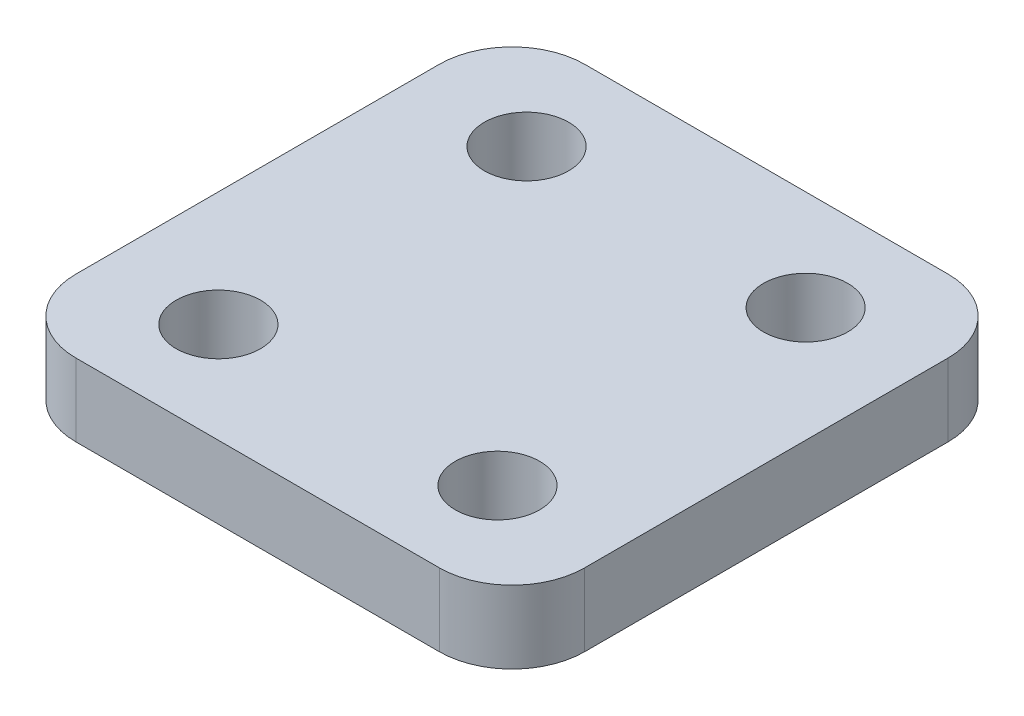
ISO-10303-21;
HEADER;
FILE_DESCRIPTION(('STEP AP214'),'2;1');
FILE_NAME('part.step','',(''),(''),'','','');
FILE_SCHEMA(('AUTOMOTIVE_DESIGN { 1 0 10303 214 1 1 1 1 }'));
ENDSEC;
DATA;
#1=APPLICATION_CONTEXT('core data for automotive mechanical design processes');
#2=APPLICATION_PROTOCOL_DEFINITION('international standard','automotive_design',2000,#1);
#3=PRODUCT_CONTEXT('',#1,'mechanical');
#4=PRODUCT('Part','Part','',(#3));
#5=PRODUCT_RELATED_PRODUCT_CATEGORY('part','',(#4));
#6=PRODUCT_DEFINITION_FORMATION('','',#4);
#7=PRODUCT_DEFINITION_CONTEXT('part definition',#1,'design');
#8=PRODUCT_DEFINITION('design','',#6,#7);
#9=PRODUCT_DEFINITION_SHAPE('','',#8);
#10=(LENGTH_UNIT() NAMED_UNIT(*) SI_UNIT(.MILLI.,.METRE.));
#11=(NAMED_UNIT(*) PLANE_ANGLE_UNIT() SI_UNIT($,.RADIAN.));
#12=(NAMED_UNIT(*) SI_UNIT($,.STERADIAN.) SOLID_ANGLE_UNIT());
#13=UNCERTAINTY_MEASURE_WITH_UNIT(LENGTH_MEASURE(1.E-05),#10,'distance_accuracy_value','');
#14=(GEOMETRIC_REPRESENTATION_CONTEXT(3) GLOBAL_UNCERTAINTY_ASSIGNED_CONTEXT((#13)) GLOBAL_UNIT_ASSIGNED_CONTEXT((#10,
#11,#12)) REPRESENTATION_CONTEXT('',''));
#15=CARTESIAN_POINT('',(0.,0.,0.));
#16=DIRECTION('',(0.,0.,1.));
#17=DIRECTION('',(1.,0.,0.));
#18=AXIS2_PLACEMENT_3D('',#15,#16,#17);
#19=CARTESIAN_POINT('',(8.89,2.54,8.89));
#20=DIRECTION('',(-1.,0.,0.));
#21=DIRECTION('',(0.,0.,1.));
#22=AXIS2_PLACEMENT_3D('',#19,#20,#21);
#23=PLANE('',#22);
#24=DIRECTION('',(0.,0.,-1.));
#25=VECTOR('',#24,1.);
#26=CARTESIAN_POINT('',(8.89,0.,8.89));
#27=LINE('',#26,#25);
#28=CARTESIAN_POINT('',(8.89,0.,6.35));
#29=VERTEX_POINT('',#28);
#30=CARTESIAN_POINT('',(8.89,0.,-6.35));
#31=VERTEX_POINT('',#30);
#32=EDGE_CURVE('E136',#29,#31,#27,.T.);
#33=ORIENTED_EDGE('',*,*,#32,.T.);
#34=DIRECTION('',(0.,-1.,0.));
#35=VECTOR('',#34,1.);
#36=CARTESIAN_POINT('',(8.89,2.54,-6.35));
#37=LINE('',#36,#35);
#38=CARTESIAN_POINT('',(8.89,2.54,-6.35));
#39=VERTEX_POINT('',#38);
#40=EDGE_CURVE('E159',#31,#39,#37,.F.);
#41=ORIENTED_EDGE('',*,*,#40,.T.);
#42=DIRECTION('',(0.,0.,-1.));
#43=VECTOR('',#42,1.);
#44=CARTESIAN_POINT('',(8.89,2.54,8.89));
#45=LINE('',#44,#43);
#46=CARTESIAN_POINT('',(8.89,2.54,6.35));
#47=VERTEX_POINT('',#46);
#48=EDGE_CURVE('E134',#47,#39,#45,.T.);
#49=ORIENTED_EDGE('',*,*,#48,.F.);
#50=DIRECTION('',(0.,-1.,0.));
#51=VECTOR('',#50,1.);
#52=CARTESIAN_POINT('',(8.89,2.54,6.35));
#53=LINE('',#52,#51);
#54=EDGE_CURVE('E156',#47,#29,#53,.T.);
#55=ORIENTED_EDGE('',*,*,#54,.T.);
#56=EDGE_LOOP('',(#33,#41,#49,#55));
#57=FACE_BOUND('',#56,.T.);
#58=ADVANCED_FACE('F41',(#57),#23,.F.);
#59=CARTESIAN_POINT('',(-8.89,2.54,-8.89));
#60=DIRECTION('',(0.,0.,1.));
#61=DIRECTION('',(1.,0.,0.));
#62=AXIS2_PLACEMENT_3D('',#59,#60,#61);
#63=PLANE('',#62);
#64=DIRECTION('',(-1.,0.,0.));
#65=VECTOR('',#64,1.);
#66=CARTESIAN_POINT('',(-8.89,0.,-8.89));
#67=LINE('',#66,#65);
#68=CARTESIAN_POINT('',(6.35,0.,-8.89));
#69=VERTEX_POINT('',#68);
#70=CARTESIAN_POINT('',(-6.35,0.,-8.89));
#71=VERTEX_POINT('',#70);
#72=EDGE_CURVE('E132',#69,#71,#67,.T.);
#73=ORIENTED_EDGE('',*,*,#72,.T.);
#74=DIRECTION('',(0.,-1.,0.));
#75=VECTOR('',#74,1.);
#76=CARTESIAN_POINT('',(-6.35,2.54,-8.89));
#77=LINE('',#76,#75);
#78=CARTESIAN_POINT('',(-6.35,2.54,-8.89));
#79=VERTEX_POINT('',#78);
#80=EDGE_CURVE('E111',#71,#79,#77,.F.);
#81=ORIENTED_EDGE('',*,*,#80,.T.);
#82=DIRECTION('',(-1.,0.,0.));
#83=VECTOR('',#82,1.);
#84=CARTESIAN_POINT('',(-8.89,2.54,-8.89));
#85=LINE('',#84,#83);
#86=CARTESIAN_POINT('',(6.35,2.54,-8.89));
#87=VERTEX_POINT('',#86);
#88=EDGE_CURVE('E175',#87,#79,#85,.T.);
#89=ORIENTED_EDGE('',*,*,#88,.F.);
#90=DIRECTION('',(0.,-1.,0.));
#91=VECTOR('',#90,1.);
#92=CARTESIAN_POINT('',(6.35,2.54,-8.89));
#93=LINE('',#92,#91);
#94=EDGE_CURVE('E116',#87,#69,#93,.T.);
#95=ORIENTED_EDGE('',*,*,#94,.T.);
#96=EDGE_LOOP('',(#73,#81,#89,#95));
#97=FACE_BOUND('',#96,.T.);
#98=ADVANCED_FACE('F220',(#97),#63,.F.);
#99=CARTESIAN_POINT('',(-8.89,2.54,8.89));
#100=DIRECTION('',(1.,0.,0.));
#101=DIRECTION('',(0.,0.,-1.));
#102=AXIS2_PLACEMENT_3D('',#99,#100,#101);
#103=PLANE('',#102);
#104=DIRECTION('',(0.,0.,1.));
#105=VECTOR('',#104,1.);
#106=CARTESIAN_POINT('',(-8.89,2.54,8.89));
#107=LINE('',#106,#105);
#108=CARTESIAN_POINT('',(-8.89,2.54,-6.35));
#109=VERTEX_POINT('',#108);
#110=CARTESIAN_POINT('',(-8.89,2.54,6.35));
#111=VERTEX_POINT('',#110);
#112=EDGE_CURVE('E125',#109,#111,#107,.T.);
#113=ORIENTED_EDGE('',*,*,#112,.F.);
#114=DIRECTION('',(0.,-1.,0.));
#115=VECTOR('',#114,1.);
#116=CARTESIAN_POINT('',(-8.89,2.54,-6.35));
#117=LINE('',#116,#115);
#118=CARTESIAN_POINT('',(-8.89,0.,-6.35));
#119=VERTEX_POINT('',#118);
#120=EDGE_CURVE('E110',#109,#119,#117,.T.);
#121=ORIENTED_EDGE('',*,*,#120,.T.);
#122=DIRECTION('',(0.,0.,1.));
#123=VECTOR('',#122,1.);
#124=CARTESIAN_POINT('',(-8.89,0.,8.89));
#125=LINE('',#124,#123);
#126=CARTESIAN_POINT('',(-8.89,0.,6.35));
#127=VERTEX_POINT('',#126);
#128=EDGE_CURVE('E123',#119,#127,#125,.T.);
#129=ORIENTED_EDGE('',*,*,#128,.T.);
#130=DIRECTION('',(0.,-1.,0.));
#131=VECTOR('',#130,1.);
#132=CARTESIAN_POINT('',(-8.89,2.54,6.35));
#133=LINE('',#132,#131);
#134=EDGE_CURVE('E127',#127,#111,#133,.F.);
#135=ORIENTED_EDGE('',*,*,#134,.T.);
#136=EDGE_LOOP('',(#113,#121,#129,#135));
#137=FACE_BOUND('',#136,.T.);
#138=ADVANCED_FACE('F122',(#137),#103,.F.);
#139=CARTESIAN_POINT('',(-8.89,2.54,8.89));
#140=DIRECTION('',(0.,0.,-1.));
#141=DIRECTION('',(-1.,0.,0.));
#142=AXIS2_PLACEMENT_3D('',#139,#140,#141);
#143=PLANE('',#142);
#144=DIRECTION('',(1.,0.,0.));
#145=VECTOR('',#144,1.);
#146=CARTESIAN_POINT('',(-8.89,0.,8.89));
#147=LINE('',#146,#145);
#148=CARTESIAN_POINT('',(-6.35,0.,8.89));
#149=VERTEX_POINT('',#148);
#150=CARTESIAN_POINT('',(6.35,0.,8.89));
#151=VERTEX_POINT('',#150);
#152=EDGE_CURVE('E131',#149,#151,#147,.T.);
#153=ORIENTED_EDGE('',*,*,#152,.T.);
#154=DIRECTION('',(0.,-1.,0.));
#155=VECTOR('',#154,1.);
#156=CARTESIAN_POINT('',(6.35,2.54,8.89));
#157=LINE('',#156,#155);
#158=CARTESIAN_POINT('',(6.35,2.54,8.89));
#159=VERTEX_POINT('',#158);
#160=EDGE_CURVE('E11',#151,#159,#157,.F.);
#161=ORIENTED_EDGE('',*,*,#160,.T.);
#162=DIRECTION('',(1.,0.,0.));
#163=VECTOR('',#162,1.);
#164=CARTESIAN_POINT('',(-8.89,2.54,8.89));
#165=LINE('',#164,#163);
#166=CARTESIAN_POINT('',(-6.35,2.54,8.89));
#167=VERTEX_POINT('',#166);
#168=EDGE_CURVE('E140',#167,#159,#165,.T.);
#169=ORIENTED_EDGE('',*,*,#168,.F.);
#170=DIRECTION('',(0.,-1.,0.));
#171=VECTOR('',#170,1.);
#172=CARTESIAN_POINT('',(-6.35,2.54,8.89));
#173=LINE('',#172,#171);
#174=EDGE_CURVE('E49',#167,#149,#173,.T.);
#175=ORIENTED_EDGE('',*,*,#174,.T.);
#176=EDGE_LOOP('',(#153,#161,#169,#175));
#177=FACE_BOUND('',#176,.T.);
#178=ADVANCED_FACE('F162',(#177),#143,.F.);
#179=CARTESIAN_POINT('',(0.,2.54,0.));
#180=DIRECTION('',(0.,-1.,0.));
#181=DIRECTION('',(0.,0.,-1.));
#182=AXIS2_PLACEMENT_3D('',#179,#180,#181);
#183=PLANE('',#182);
#184=CARTESIAN_POINT('',(4.8768,2.54,-5.3848));
#185=DIRECTION('',(0.,1.,0.));
#186=DIRECTION('',(0.,0.,-1.));
#187=AXIS2_PLACEMENT_3D('',#184,#185,#186);
#188=CIRCLE('',#187,1.4732);
#189=CARTESIAN_POINT('',(4.8768,2.54,-6.858));
#190=VERTEX_POINT('',#189);
#191=EDGE_CURVE('E194',#190,#190,#188,.T.);
#192=ORIENTED_EDGE('',*,*,#191,.F.);
#193=EDGE_LOOP('',(#192));
#194=FACE_BOUND('',#193,.T.);
#195=CARTESIAN_POINT('',(4.8768,2.54,5.3848));
#196=DIRECTION('',(0.,1.,0.));
#197=DIRECTION('',(0.,0.,1.));
#198=AXIS2_PLACEMENT_3D('',#195,#196,#197);
#199=CIRCLE('',#198,1.4732);
#200=CARTESIAN_POINT('',(4.8768,2.54,6.858));
#201=VERTEX_POINT('',#200);
#202=EDGE_CURVE('E200',#201,#201,#199,.T.);
#203=ORIENTED_EDGE('',*,*,#202,.F.);
#204=EDGE_LOOP('',(#203));
#205=FACE_BOUND('',#204,.T.);
#206=CARTESIAN_POINT('',(-4.8768,2.54,5.3848));
#207=DIRECTION('',(0.,1.,0.));
#208=DIRECTION('',(0.,0.,-1.));
#209=AXIS2_PLACEMENT_3D('',#206,#207,#208);
#210=CIRCLE('',#209,1.4732);
#211=CARTESIAN_POINT('',(-4.8768,2.54,3.9116));
#212=VERTEX_POINT('',#211);
#213=EDGE_CURVE('E189',#212,#212,#210,.T.);
#214=ORIENTED_EDGE('',*,*,#213,.F.);
#215=EDGE_LOOP('',(#214));
#216=FACE_BOUND('',#215,.T.);
#217=CARTESIAN_POINT('',(-4.8768,2.54,-5.3848));
#218=DIRECTION('',(0.,1.,0.));
#219=DIRECTION('',(0.,0.,1.));
#220=AXIS2_PLACEMENT_3D('',#217,#218,#219);
#221=CIRCLE('',#220,1.4732);
#222=CARTESIAN_POINT('',(-4.8768,2.54,-3.9116));
#223=VERTEX_POINT('',#222);
#224=EDGE_CURVE('E180',#223,#223,#221,.T.);
#225=ORIENTED_EDGE('',*,*,#224,.F.);
#226=EDGE_LOOP('',(#225));
#227=FACE_BOUND('',#226,.T.);
#228=ORIENTED_EDGE('',*,*,#88,.T.);
#229=CARTESIAN_POINT('',(-6.35,2.54,-6.35));
#230=DIRECTION('',(0.,-1.,0.));
#231=DIRECTION('',(0.,0.,-1.));
#232=AXIS2_PLACEMENT_3D('',#229,#230,#231);
#233=CIRCLE('',#232,2.54);
#234=EDGE_CURVE('E154',#79,#109,#233,.F.);
#235=ORIENTED_EDGE('',*,*,#234,.T.);
#236=ORIENTED_EDGE('',*,*,#112,.T.);
#237=CARTESIAN_POINT('',(-6.35,2.54,6.35));
#238=DIRECTION('',(0.,-1.,0.));
#239=DIRECTION('',(0.,0.,-1.));
#240=AXIS2_PLACEMENT_3D('',#237,#238,#239);
#241=CIRCLE('',#240,2.54);
#242=EDGE_CURVE('E61',#111,#167,#241,.F.);
#243=ORIENTED_EDGE('',*,*,#242,.T.);
#244=ORIENTED_EDGE('',*,*,#168,.T.);
#245=CARTESIAN_POINT('',(6.35,2.54,6.35));
#246=DIRECTION('',(0.,-1.,0.));
#247=DIRECTION('',(0.,0.,-1.));
#248=AXIS2_PLACEMENT_3D('',#245,#246,#247);
#249=CIRCLE('',#248,2.54);
#250=EDGE_CURVE('E150',#159,#47,#249,.F.);
#251=ORIENTED_EDGE('',*,*,#250,.T.);
#252=ORIENTED_EDGE('',*,*,#48,.T.);
#253=CARTESIAN_POINT('',(6.35,2.54,-6.35));
#254=DIRECTION('',(0.,-1.,0.));
#255=DIRECTION('',(0.,0.,-1.));
#256=AXIS2_PLACEMENT_3D('',#253,#254,#255);
#257=CIRCLE('',#256,2.54);
#258=EDGE_CURVE('E152',#39,#87,#257,.F.);
#259=ORIENTED_EDGE('',*,*,#258,.T.);
#260=EDGE_LOOP('',(#228,#235,#236,#243,#244,#251,#252,#259));
#261=FACE_BOUND('',#260,.T.);
#262=ADVANCED_FACE('F211',(#194,#205,#216,#227,#261),#183,.F.);
#263=CARTESIAN_POINT('',(0.,0.,0.));
#264=DIRECTION('',(0.,-1.,0.));
#265=DIRECTION('',(0.,0.,-1.));
#266=AXIS2_PLACEMENT_3D('',#263,#264,#265);
#267=PLANE('',#266);
#268=CARTESIAN_POINT('',(4.8768,0.,-5.3848));
#269=DIRECTION('',(0.,1.,0.));
#270=DIRECTION('',(0.,0.,-1.));
#271=AXIS2_PLACEMENT_3D('',#268,#269,#270);
#272=CIRCLE('',#271,1.4732);
#273=CARTESIAN_POINT('',(4.8768,0.,-6.858));
#274=VERTEX_POINT('',#273);
#275=EDGE_CURVE('E191',#274,#274,#272,.T.);
#276=ORIENTED_EDGE('',*,*,#275,.T.);
#277=EDGE_LOOP('',(#276));
#278=FACE_BOUND('',#277,.T.);
#279=CARTESIAN_POINT('',(4.8768,0.,5.3848));
#280=DIRECTION('',(0.,1.,0.));
#281=DIRECTION('',(0.,0.,1.));
#282=AXIS2_PLACEMENT_3D('',#279,#280,#281);
#283=CIRCLE('',#282,1.4732);
#284=CARTESIAN_POINT('',(4.8768,0.,6.858));
#285=VERTEX_POINT('',#284);
#286=EDGE_CURVE('E197',#285,#285,#283,.T.);
#287=ORIENTED_EDGE('',*,*,#286,.T.);
#288=EDGE_LOOP('',(#287));
#289=FACE_BOUND('',#288,.T.);
#290=CARTESIAN_POINT('',(-4.8768,0.,5.3848));
#291=DIRECTION('',(0.,1.,0.));
#292=DIRECTION('',(0.,0.,-1.));
#293=AXIS2_PLACEMENT_3D('',#290,#291,#292);
#294=CIRCLE('',#293,1.4732);
#295=CARTESIAN_POINT('',(-4.8768,0.,3.9116));
#296=VERTEX_POINT('',#295);
#297=EDGE_CURVE('E203',#296,#296,#294,.T.);
#298=ORIENTED_EDGE('',*,*,#297,.T.);
#299=EDGE_LOOP('',(#298));
#300=FACE_BOUND('',#299,.T.);
#301=CARTESIAN_POINT('',(-4.8768,0.,-5.3848));
#302=DIRECTION('',(0.,1.,0.));
#303=DIRECTION('',(0.,0.,1.));
#304=AXIS2_PLACEMENT_3D('',#301,#302,#303);
#305=CIRCLE('',#304,1.4732);
#306=CARTESIAN_POINT('',(-4.8768,0.,-3.9116));
#307=VERTEX_POINT('',#306);
#308=EDGE_CURVE('E184',#307,#307,#305,.T.);
#309=ORIENTED_EDGE('',*,*,#308,.T.);
#310=EDGE_LOOP('',(#309));
#311=FACE_BOUND('',#310,.T.);
#312=ORIENTED_EDGE('',*,*,#128,.F.);
#313=CARTESIAN_POINT('',(-6.35,0.,-6.35));
#314=DIRECTION('',(0.,-1.,0.));
#315=DIRECTION('',(0.,0.,-1.));
#316=AXIS2_PLACEMENT_3D('',#313,#314,#315);
#317=CIRCLE('',#316,2.54);
#318=EDGE_CURVE('E106',#119,#71,#317,.T.);
#319=ORIENTED_EDGE('',*,*,#318,.T.);
#320=ORIENTED_EDGE('',*,*,#72,.F.);
#321=CARTESIAN_POINT('',(6.35,0.,-6.35));
#322=DIRECTION('',(0.,-1.,0.));
#323=DIRECTION('',(0.,0.,-1.));
#324=AXIS2_PLACEMENT_3D('',#321,#322,#323);
#325=CIRCLE('',#324,2.54);
#326=EDGE_CURVE('E117',#69,#31,#325,.T.);
#327=ORIENTED_EDGE('',*,*,#326,.T.);
#328=ORIENTED_EDGE('',*,*,#32,.F.);
#329=CARTESIAN_POINT('',(6.35,0.,6.35));
#330=DIRECTION('',(0.,-1.,0.));
#331=DIRECTION('',(0.,0.,-1.));
#332=AXIS2_PLACEMENT_3D('',#329,#330,#331);
#333=CIRCLE('',#332,2.54);
#334=EDGE_CURVE('E143',#29,#151,#333,.T.);
#335=ORIENTED_EDGE('',*,*,#334,.T.);
#336=ORIENTED_EDGE('',*,*,#152,.F.);
#337=CARTESIAN_POINT('',(-6.35,0.,6.35));
#338=DIRECTION('',(0.,-1.,0.));
#339=DIRECTION('',(0.,0.,-1.));
#340=AXIS2_PLACEMENT_3D('',#337,#338,#339);
#341=CIRCLE('',#340,2.54);
#342=EDGE_CURVE('E126',#149,#127,#341,.T.);
#343=ORIENTED_EDGE('',*,*,#342,.T.);
#344=EDGE_LOOP('',(#312,#319,#320,#327,#328,#335,#336,#343));
#345=FACE_BOUND('',#344,.T.);
#346=ADVANCED_FACE('F129',(#278,#289,#300,#311,#345),#267,.T.);
#347=CARTESIAN_POINT('',(-4.8768,0.,-5.3848));
#348=DIRECTION('',(0.,1.,0.));
#349=DIRECTION('',(0.,0.,1.));
#350=AXIS2_PLACEMENT_3D('',#347,#348,#349);
#351=CYLINDRICAL_SURFACE('',#350,1.4732);
#352=ORIENTED_EDGE('',*,*,#308,.F.);
#353=EDGE_LOOP('',(#352));
#354=FACE_BOUND('',#353,.T.);
#355=ORIENTED_EDGE('',*,*,#224,.T.);
#356=EDGE_LOOP('',(#355));
#357=FACE_BOUND('',#356,.T.);
#358=ADVANCED_FACE('F244',(#354,#357),#351,.F.);
#359=CARTESIAN_POINT('',(-4.8768,0.,5.3848));
#360=DIRECTION('',(0.,1.,0.));
#361=DIRECTION('',(0.,0.,1.));
#362=AXIS2_PLACEMENT_3D('',#359,#360,#361);
#363=CYLINDRICAL_SURFACE('',#362,1.4732);
#364=ORIENTED_EDGE('',*,*,#297,.F.);
#365=EDGE_LOOP('',(#364));
#366=FACE_BOUND('',#365,.T.);
#367=ORIENTED_EDGE('',*,*,#213,.T.);
#368=EDGE_LOOP('',(#367));
#369=FACE_BOUND('',#368,.T.);
#370=ADVANCED_FACE('F209',(#366,#369),#363,.F.);
#371=CARTESIAN_POINT('',(4.8768,0.,5.3848));
#372=DIRECTION('',(0.,1.,0.));
#373=DIRECTION('',(0.,0.,1.));
#374=AXIS2_PLACEMENT_3D('',#371,#372,#373);
#375=CYLINDRICAL_SURFACE('',#374,1.4732);
#376=ORIENTED_EDGE('',*,*,#286,.F.);
#377=EDGE_LOOP('',(#376));
#378=FACE_BOUND('',#377,.T.);
#379=ORIENTED_EDGE('',*,*,#202,.T.);
#380=EDGE_LOOP('',(#379));
#381=FACE_BOUND('',#380,.T.);
#382=ADVANCED_FACE('F251',(#378,#381),#375,.F.);
#383=CARTESIAN_POINT('',(4.8768,0.,-5.3848));
#384=DIRECTION('',(0.,1.,0.));
#385=DIRECTION('',(0.,0.,1.));
#386=AXIS2_PLACEMENT_3D('',#383,#384,#385);
#387=CYLINDRICAL_SURFACE('',#386,1.4732);
#388=ORIENTED_EDGE('',*,*,#275,.F.);
#389=EDGE_LOOP('',(#388));
#390=FACE_BOUND('',#389,.T.);
#391=ORIENTED_EDGE('',*,*,#191,.T.);
#392=EDGE_LOOP('',(#391));
#393=FACE_BOUND('',#392,.T.);
#394=ADVANCED_FACE('F229',(#390,#393),#387,.F.);
#395=CARTESIAN_POINT('',(-6.35,2.54,-6.35));
#396=DIRECTION('',(0.,-1.,0.));
#397=DIRECTION('',(0.,0.,-1.));
#398=AXIS2_PLACEMENT_3D('',#395,#396,#397);
#399=CYLINDRICAL_SURFACE('',#398,2.54);
#400=ORIENTED_EDGE('',*,*,#234,.F.);
#401=ORIENTED_EDGE('',*,*,#80,.F.);
#402=ORIENTED_EDGE('',*,*,#318,.F.);
#403=ORIENTED_EDGE('',*,*,#120,.F.);
#404=EDGE_LOOP('',(#400,#401,#402,#403));
#405=FACE_BOUND('',#404,.T.);
#406=ADVANCED_FACE('F109',(#405),#399,.T.);
#407=CARTESIAN_POINT('',(6.35,2.54,-6.35));
#408=DIRECTION('',(0.,-1.,0.));
#409=DIRECTION('',(0.,0.,-1.));
#410=AXIS2_PLACEMENT_3D('',#407,#408,#409);
#411=CYLINDRICAL_SURFACE('',#410,2.54);
#412=ORIENTED_EDGE('',*,*,#258,.F.);
#413=ORIENTED_EDGE('',*,*,#40,.F.);
#414=ORIENTED_EDGE('',*,*,#326,.F.);
#415=ORIENTED_EDGE('',*,*,#94,.F.);
#416=EDGE_LOOP('',(#412,#413,#414,#415));
#417=FACE_BOUND('',#416,.T.);
#418=ADVANCED_FACE('F222',(#417),#411,.T.);
#419=CARTESIAN_POINT('',(6.35,2.54,6.35));
#420=DIRECTION('',(0.,-1.,0.));
#421=DIRECTION('',(0.,0.,-1.));
#422=AXIS2_PLACEMENT_3D('',#419,#420,#421);
#423=CYLINDRICAL_SURFACE('',#422,2.54);
#424=ORIENTED_EDGE('',*,*,#250,.F.);
#425=ORIENTED_EDGE('',*,*,#160,.F.);
#426=ORIENTED_EDGE('',*,*,#334,.F.);
#427=ORIENTED_EDGE('',*,*,#54,.F.);
#428=EDGE_LOOP('',(#424,#425,#426,#427));
#429=FACE_BOUND('',#428,.T.);
#430=ADVANCED_FACE('F169',(#429),#423,.T.);
#431=CARTESIAN_POINT('',(-6.35,2.54,6.35));
#432=DIRECTION('',(0.,-1.,0.));
#433=DIRECTION('',(0.,0.,-1.));
#434=AXIS2_PLACEMENT_3D('',#431,#432,#433);
#435=CYLINDRICAL_SURFACE('',#434,2.54);
#436=ORIENTED_EDGE('',*,*,#242,.F.);
#437=ORIENTED_EDGE('',*,*,#134,.F.);
#438=ORIENTED_EDGE('',*,*,#342,.F.);
#439=ORIENTED_EDGE('',*,*,#174,.F.);
#440=EDGE_LOOP('',(#436,#437,#438,#439));
#441=FACE_BOUND('',#440,.T.);
#442=ADVANCED_FACE('F43',(#441),#435,.T.);
#443=CLOSED_SHELL('',(#58,#98,#138,#178,#262,#346,#358,#370,#382,#394,#406,#418,#430,#442));
#444=MANIFOLD_SOLID_BREP('B2',#443);
#445=ADVANCED_BREP_SHAPE_REPRESENTATION('',(#18,#444),#14);
#446=SHAPE_DEFINITION_REPRESENTATION(#9,#445);
ENDSEC;
END-ISO-10303-21;
